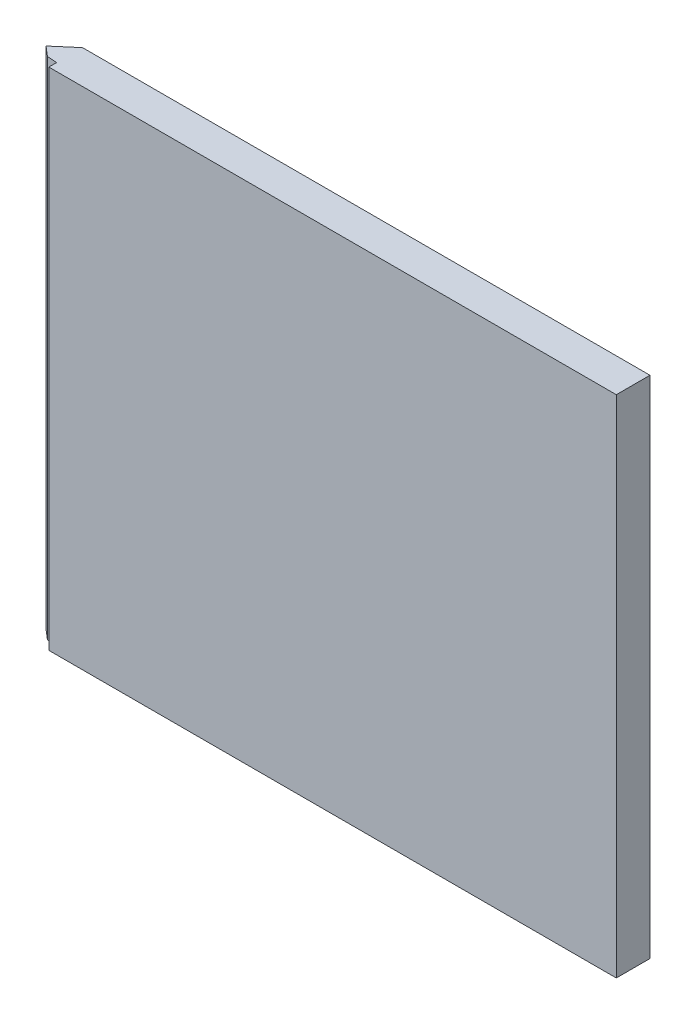
ISO-10303-21;
HEADER;
FILE_DESCRIPTION(('STEP AP214'),'2;1');
FILE_NAME('part.step','',(''),(''),'','','');
FILE_SCHEMA(('AUTOMOTIVE_DESIGN { 1 0 10303 214 1 1 1 1 }'));
ENDSEC;
DATA;
#1=APPLICATION_CONTEXT('core data for automotive mechanical design processes');
#2=APPLICATION_PROTOCOL_DEFINITION('international standard','automotive_design',2000,#1);
#3=PRODUCT_CONTEXT('',#1,'mechanical');
#4=PRODUCT('Part','Part','',(#3));
#5=PRODUCT_RELATED_PRODUCT_CATEGORY('part','',(#4));
#6=PRODUCT_DEFINITION_FORMATION('','',#4);
#7=PRODUCT_DEFINITION_CONTEXT('part definition',#1,'design');
#8=PRODUCT_DEFINITION('design','',#6,#7);
#9=PRODUCT_DEFINITION_SHAPE('','',#8);
#10=(LENGTH_UNIT() NAMED_UNIT(*) SI_UNIT(.MILLI.,.METRE.));
#11=(NAMED_UNIT(*) PLANE_ANGLE_UNIT() SI_UNIT($,.RADIAN.));
#12=(NAMED_UNIT(*) SI_UNIT($,.STERADIAN.) SOLID_ANGLE_UNIT());
#13=UNCERTAINTY_MEASURE_WITH_UNIT(LENGTH_MEASURE(1.E-05),#10,'distance_accuracy_value','');
#14=(GEOMETRIC_REPRESENTATION_CONTEXT(3) GLOBAL_UNCERTAINTY_ASSIGNED_CONTEXT((#13)) GLOBAL_UNIT_ASSIGNED_CONTEXT((#10,
#11,#12)) REPRESENTATION_CONTEXT('',''));
#15=CARTESIAN_POINT('',(0.,0.,0.));
#16=DIRECTION('',(0.,0.,1.));
#17=DIRECTION('',(1.,0.,0.));
#18=AXIS2_PLACEMENT_3D('',#15,#16,#17);
#19=CARTESIAN_POINT('',(-52.6392873822287,-61.1261574074074,6.));
#20=DIRECTION('',(0.,1.,0.));
#21=DIRECTION('',(0.,0.,1.));
#22=AXIS2_PLACEMENT_3D('',#19,#20,#21);
#23=PLANE('',#22);
#24=DIRECTION('',(1.,0.,0.));
#25=VECTOR('',#24,1.);
#26=CARTESIAN_POINT('',(-52.6392873822287,-61.1261574074074,6.));
#27=LINE('',#26,#25);
#28=CARTESIAN_POINT('',(-49.1389873950848,-61.1261574074074,6.));
#29=VERTEX_POINT('',#28);
#30=CARTESIAN_POINT('',(51.9607126177713,-61.1261574074074,6.));
#31=VERTEX_POINT('',#30);
#32=EDGE_CURVE('E96',#29,#31,#27,.T.);
#33=ORIENTED_EDGE('',*,*,#32,.F.);
#34=DIRECTION('',(0.,0.,1.));
#35=VECTOR('',#34,1.);
#36=CARTESIAN_POINT('',(-49.1389873950848,-61.1261574074074,4.61983990015824));
#37=LINE('',#36,#35);
#38=CARTESIAN_POINT('',(-49.1389873950848,-61.1261574074074,4.61983990015824));
#39=VERTEX_POINT('',#38);
#40=EDGE_CURVE('E127',#39,#29,#37,.T.);
#41=ORIENTED_EDGE('',*,*,#40,.F.);
#42=DIRECTION('',(0.997663862477,0.,0.0683141091391325));
#43=VECTOR('',#42,1.);
#44=CARTESIAN_POINT('',(-50.8891373886567,-61.1261574074074,4.5));
#45=LINE('',#44,#43);
#46=CARTESIAN_POINT('',(-50.8891373886567,-61.1261574074074,4.5));
#47=VERTEX_POINT('',#46);
#48=EDGE_CURVE('E123',#47,#39,#45,.T.);
#49=ORIENTED_EDGE('',*,*,#48,.F.);
#50=DIRECTION('',(0.759284162070273,0.,0.650759219088937));
#51=VECTOR('',#50,1.);
#52=CARTESIAN_POINT('',(-52.6392873822287,-61.1261574074074,3.));
#53=LINE('',#52,#51);
#54=CARTESIAN_POINT('',(-52.6392873822287,-61.1261574074074,3.));
#55=VERTEX_POINT('',#54);
#56=EDGE_CURVE('E109',#55,#47,#53,.T.);
#57=ORIENTED_EDGE('',*,*,#56,.F.);
#58=DIRECTION('',(-0.759256602365297,0.,0.650791373455968));
#59=VECTOR('',#58,1.);
#60=CARTESIAN_POINT('',(-52.6392873822287,-61.1261574074074,3.));
#61=LINE('',#60,#59);
#62=CARTESIAN_POINT('',(-49.1392873822287,-61.1261574074074,0.));
#63=VERTEX_POINT('',#62);
#64=EDGE_CURVE('E115',#63,#55,#61,.T.);
#65=ORIENTED_EDGE('',*,*,#64,.F.);
#66=DIRECTION('',(1.,0.,0.));
#67=VECTOR('',#66,1.);
#68=CARTESIAN_POINT('',(-52.6392873822287,-61.1261574074074,0.));
#69=LINE('',#68,#67);
#70=CARTESIAN_POINT('',(51.9607126177713,-61.1261574074074,0.));
#71=VERTEX_POINT('',#70);
#72=EDGE_CURVE('E82',#63,#71,#69,.T.);
#73=ORIENTED_EDGE('',*,*,#72,.T.);
#74=DIRECTION('',(0.,0.,-1.));
#75=VECTOR('',#74,1.);
#76=CARTESIAN_POINT('',(51.9607126177713,-61.1261574074074,6.));
#77=LINE('',#76,#75);
#78=EDGE_CURVE('E43',#31,#71,#77,.T.);
#79=ORIENTED_EDGE('',*,*,#78,.F.);
#80=EDGE_LOOP('',(#33,#41,#49,#57,#65,#73,#79));
#81=FACE_BOUND('',#80,.T.);
#82=ADVANCED_FACE('F36',(#81),#23,.F.);
#83=CARTESIAN_POINT('',(51.9607126177713,28.8738425925926,6.));
#84=DIRECTION('',(-1.,0.,0.));
#85=DIRECTION('',(0.,-1.,0.));
#86=AXIS2_PLACEMENT_3D('',#83,#84,#85);
#87=PLANE('',#86);
#88=DIRECTION('',(0.,1.,0.));
#89=VECTOR('',#88,1.);
#90=CARTESIAN_POINT('',(51.9607126177713,28.8738425925926,0.));
#91=LINE('',#90,#89);
#92=CARTESIAN_POINT('',(51.9607126177713,28.8738425925926,0.));
#93=VERTEX_POINT('',#92);
#94=EDGE_CURVE('E72',#71,#93,#91,.T.);
#95=ORIENTED_EDGE('',*,*,#94,.T.);
#96=DIRECTION('',(0.,0.,-1.));
#97=VECTOR('',#96,1.);
#98=CARTESIAN_POINT('',(51.9607126177713,28.8738425925926,6.));
#99=LINE('',#98,#97);
#100=CARTESIAN_POINT('',(51.9607126177713,28.8738425925926,6.));
#101=VERTEX_POINT('',#100);
#102=EDGE_CURVE('E75',#101,#93,#99,.T.);
#103=ORIENTED_EDGE('',*,*,#102,.F.);
#104=DIRECTION('',(0.,1.,0.));
#105=VECTOR('',#104,1.);
#106=CARTESIAN_POINT('',(51.9607126177713,28.8738425925926,6.));
#107=LINE('',#106,#105);
#108=EDGE_CURVE('E59',#31,#101,#107,.T.);
#109=ORIENTED_EDGE('',*,*,#108,.F.);
#110=ORIENTED_EDGE('',*,*,#78,.T.);
#111=EDGE_LOOP('',(#95,#103,#109,#110));
#112=FACE_BOUND('',#111,.T.);
#113=ADVANCED_FACE('F74',(#112),#87,.F.);
#114=CARTESIAN_POINT('',(-52.6392873822287,28.8738425925926,6.));
#115=DIRECTION('',(0.,-1.,0.));
#116=DIRECTION('',(0.,0.,-1.));
#117=AXIS2_PLACEMENT_3D('',#114,#115,#116);
#118=PLANE('',#117);
#119=DIRECTION('',(0.997663862477,0.,0.0683141091391325));
#120=VECTOR('',#119,1.);
#121=CARTESIAN_POINT('',(-50.8891373886567,28.8738425925926,4.5));
#122=LINE('',#121,#120);
#123=CARTESIAN_POINT('',(-50.8891373886567,28.8738425925926,4.5));
#124=VERTEX_POINT('',#123);
#125=CARTESIAN_POINT('',(-49.1389873950848,28.8738425925926,4.61983990015824));
#126=VERTEX_POINT('',#125);
#127=EDGE_CURVE('E50',#124,#126,#122,.T.);
#128=ORIENTED_EDGE('',*,*,#127,.T.);
#129=DIRECTION('',(0.,0.,1.));
#130=VECTOR('',#129,1.);
#131=CARTESIAN_POINT('',(-49.1389873950848,28.8738425925926,4.61983990015824));
#132=LINE('',#131,#130);
#133=CARTESIAN_POINT('',(-49.1389873950848,28.8738425925926,6.));
#134=VERTEX_POINT('',#133);
#135=EDGE_CURVE('E126',#126,#134,#132,.T.);
#136=ORIENTED_EDGE('',*,*,#135,.T.);
#137=DIRECTION('',(-1.,0.,0.));
#138=VECTOR('',#137,1.);
#139=CARTESIAN_POINT('',(-52.6392873822287,28.8738425925926,6.));
#140=LINE('',#139,#138);
#141=EDGE_CURVE('E90',#101,#134,#140,.T.);
#142=ORIENTED_EDGE('',*,*,#141,.F.);
#143=ORIENTED_EDGE('',*,*,#102,.T.);
#144=DIRECTION('',(-1.,0.,0.));
#145=VECTOR('',#144,1.);
#146=CARTESIAN_POINT('',(-52.6392873822287,28.8738425925926,0.));
#147=LINE('',#146,#145);
#148=CARTESIAN_POINT('',(-49.1392873822287,28.8738425925926,0.));
#149=VERTEX_POINT('',#148);
#150=EDGE_CURVE('E81',#93,#149,#147,.T.);
#151=ORIENTED_EDGE('',*,*,#150,.T.);
#152=DIRECTION('',(-0.759256602365297,0.,0.650791373455968));
#153=VECTOR('',#152,1.);
#154=CARTESIAN_POINT('',(-54.1216403234052,28.8738425925926,4.27058823529412));
#155=LINE('',#154,#153);
#156=CARTESIAN_POINT('',(-52.6392873822287,28.8738425925926,3.));
#157=VERTEX_POINT('',#156);
#158=EDGE_CURVE('E112',#149,#157,#155,.T.);
#159=ORIENTED_EDGE('',*,*,#158,.T.);
#160=DIRECTION('',(0.759284162070273,0.,0.650759219088937));
#161=VECTOR('',#160,1.);
#162=CARTESIAN_POINT('',(-51.1569538771024,28.8738425925926,4.27046268368772));
#163=LINE('',#162,#161);
#164=EDGE_CURVE('E101',#157,#124,#163,.T.);
#165=ORIENTED_EDGE('',*,*,#164,.T.);
#166=EDGE_LOOP('',(#128,#136,#142,#143,#151,#159,#165));
#167=FACE_BOUND('',#166,.T.);
#168=ADVANCED_FACE('F86',(#167),#118,.F.);
#169=CARTESIAN_POINT('',(0.,0.,6.));
#170=DIRECTION('',(0.,0.,1.));
#171=DIRECTION('',(1.,0.,0.));
#172=AXIS2_PLACEMENT_3D('',#169,#170,#171);
#173=PLANE('',#172);
#174=DIRECTION('',(0.,1.,0.));
#175=VECTOR('',#174,1.);
#176=CARTESIAN_POINT('',(-49.1389873950848,0.,6.));
#177=LINE('',#176,#175);
#178=EDGE_CURVE('E11',#29,#134,#177,.T.);
#179=ORIENTED_EDGE('',*,*,#178,.F.);
#180=ORIENTED_EDGE('',*,*,#32,.T.);
#181=ORIENTED_EDGE('',*,*,#108,.T.);
#182=ORIENTED_EDGE('',*,*,#141,.T.);
#183=EDGE_LOOP('',(#179,#180,#181,#182));
#184=FACE_BOUND('',#183,.T.);
#185=ADVANCED_FACE('F138',(#184),#173,.T.);
#186=CARTESIAN_POINT('',(0.,0.,0.));
#187=DIRECTION('',(0.,0.,1.));
#188=DIRECTION('',(1.,0.,0.));
#189=AXIS2_PLACEMENT_3D('',#186,#187,#188);
#190=PLANE('',#189);
#191=ORIENTED_EDGE('',*,*,#72,.F.);
#192=DIRECTION('',(0.,-1.,0.));
#193=VECTOR('',#192,1.);
#194=CARTESIAN_POINT('',(-49.1392873822287,29.8738425925926,0.));
#195=LINE('',#194,#193);
#196=EDGE_CURVE('E95',#149,#63,#195,.T.);
#197=ORIENTED_EDGE('',*,*,#196,.F.);
#198=ORIENTED_EDGE('',*,*,#150,.F.);
#199=ORIENTED_EDGE('',*,*,#94,.F.);
#200=EDGE_LOOP('',(#191,#197,#198,#199));
#201=FACE_BOUND('',#200,.T.);
#202=ADVANCED_FACE('F93',(#201),#190,.F.);
#203=CARTESIAN_POINT('',(-52.6392873822287,29.8738425925926,3.));
#204=DIRECTION('',(0.650759219088937,0.,-0.759284162070273));
#205=DIRECTION('',(-0.759284162070273,0.,-0.650759219088937));
#206=AXIS2_PLACEMENT_3D('',#203,#204,#205);
#207=PLANE('',#206);
#208=ORIENTED_EDGE('',*,*,#56,.T.);
#209=DIRECTION('',(0.,-1.,0.));
#210=VECTOR('',#209,1.);
#211=CARTESIAN_POINT('',(-50.8891373886567,28.8738425925926,4.5));
#212=LINE('',#211,#210);
#213=EDGE_CURVE('E119',#124,#47,#212,.T.);
#214=ORIENTED_EDGE('',*,*,#213,.F.);
#215=ORIENTED_EDGE('',*,*,#164,.F.);
#216=DIRECTION('',(0.,-1.,0.));
#217=VECTOR('',#216,1.);
#218=CARTESIAN_POINT('',(-52.6392873822287,29.8738425925926,3.));
#219=LINE('',#218,#217);
#220=EDGE_CURVE('E106',#157,#55,#219,.T.);
#221=ORIENTED_EDGE('',*,*,#220,.T.);
#222=EDGE_LOOP('',(#208,#214,#215,#221));
#223=FACE_BOUND('',#222,.T.);
#224=ADVANCED_FACE('F162',(#223),#207,.F.);
#225=CARTESIAN_POINT('',(-52.6392873822287,29.8738425925926,3.));
#226=DIRECTION('',(0.650791373455968,0.,0.759256602365297));
#227=DIRECTION('',(0.759256602365297,0.,-0.650791373455968));
#228=AXIS2_PLACEMENT_3D('',#225,#226,#227);
#229=PLANE('',#228);
#230=ORIENTED_EDGE('',*,*,#196,.T.);
#231=ORIENTED_EDGE('',*,*,#64,.T.);
#232=ORIENTED_EDGE('',*,*,#220,.F.);
#233=ORIENTED_EDGE('',*,*,#158,.F.);
#234=EDGE_LOOP('',(#230,#231,#232,#233));
#235=FACE_BOUND('',#234,.T.);
#236=ADVANCED_FACE('F159',(#235),#229,.F.);
#237=CARTESIAN_POINT('',(-49.1389873950848,28.8738425925926,4.61983990015824));
#238=DIRECTION('',(1.,0.,0.));
#239=DIRECTION('',(0.,0.,-1.));
#240=AXIS2_PLACEMENT_3D('',#237,#238,#239);
#241=PLANE('',#240);
#242=ORIENTED_EDGE('',*,*,#40,.T.);
#243=ORIENTED_EDGE('',*,*,#178,.T.);
#244=ORIENTED_EDGE('',*,*,#135,.F.);
#245=DIRECTION('',(0.,-1.,0.));
#246=VECTOR('',#245,1.);
#247=CARTESIAN_POINT('',(-49.1389873950848,28.8738425925926,4.61983990015824));
#248=LINE('',#247,#246);
#249=EDGE_CURVE('E118',#126,#39,#248,.T.);
#250=ORIENTED_EDGE('',*,*,#249,.T.);
#251=EDGE_LOOP('',(#242,#243,#244,#250));
#252=FACE_BOUND('',#251,.T.);
#253=ADVANCED_FACE('F164',(#252),#241,.F.);
#254=CARTESIAN_POINT('',(-50.8891373886567,28.8738425925926,4.5));
#255=DIRECTION('',(0.0683141091391325,0.,-0.997663862477));
#256=DIRECTION('',(-0.997663862477,0.,-0.0683141091391325));
#257=AXIS2_PLACEMENT_3D('',#254,#255,#256);
#258=PLANE('',#257);
#259=ORIENTED_EDGE('',*,*,#48,.T.);
#260=ORIENTED_EDGE('',*,*,#249,.F.);
#261=ORIENTED_EDGE('',*,*,#127,.F.);
#262=ORIENTED_EDGE('',*,*,#213,.T.);
#263=EDGE_LOOP('',(#259,#260,#261,#262));
#264=FACE_BOUND('',#263,.T.);
#265=ADVANCED_FACE('F163',(#264),#258,.F.);
#266=CLOSED_SHELL('',(#82,#113,#168,#185,#202,#224,#236,#253,#265));
#267=MANIFOLD_SOLID_BREP('B2',#266);
#268=ADVANCED_BREP_SHAPE_REPRESENTATION('',(#18,#267),#14);
#269=SHAPE_DEFINITION_REPRESENTATION(#9,#268);
ENDSEC;
END-ISO-10303-21;
